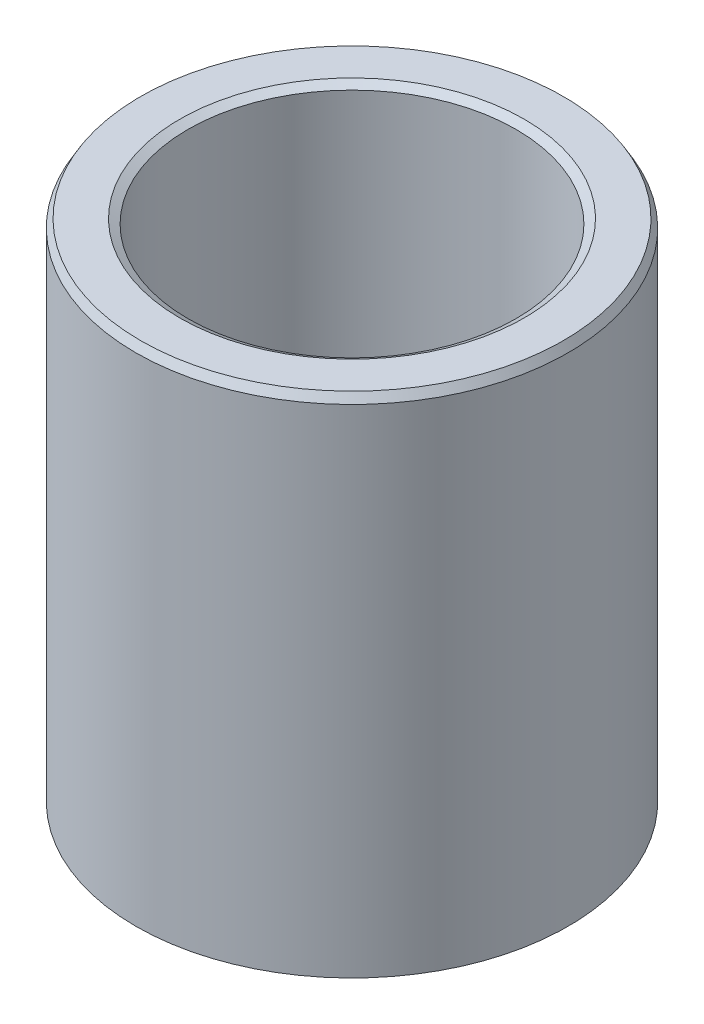
ISO-10303-21;
HEADER;
FILE_DESCRIPTION(('STEP AP214'),'2;1');
FILE_NAME('part.step','',(''),(''),'','','');
FILE_SCHEMA(('AUTOMOTIVE_DESIGN { 1 0 10303 214 1 1 1 1 }'));
ENDSEC;
DATA;
#1=APPLICATION_CONTEXT('core data for automotive mechanical design processes');
#2=APPLICATION_PROTOCOL_DEFINITION('international standard','automotive_design',2000,#1);
#3=PRODUCT_CONTEXT('',#1,'mechanical');
#4=PRODUCT('Part','Part','',(#3));
#5=PRODUCT_RELATED_PRODUCT_CATEGORY('part','',(#4));
#6=PRODUCT_DEFINITION_FORMATION('','',#4);
#7=PRODUCT_DEFINITION_CONTEXT('part definition',#1,'design');
#8=PRODUCT_DEFINITION('design','',#6,#7);
#9=PRODUCT_DEFINITION_SHAPE('','',#8);
#10=(LENGTH_UNIT() NAMED_UNIT(*) SI_UNIT(.MILLI.,.METRE.));
#11=(NAMED_UNIT(*) PLANE_ANGLE_UNIT() SI_UNIT($,.RADIAN.));
#12=(NAMED_UNIT(*) SI_UNIT($,.STERADIAN.) SOLID_ANGLE_UNIT());
#13=UNCERTAINTY_MEASURE_WITH_UNIT(LENGTH_MEASURE(1.E-05),#10,'distance_accuracy_value','');
#14=(GEOMETRIC_REPRESENTATION_CONTEXT(3) GLOBAL_UNCERTAINTY_ASSIGNED_CONTEXT((#13)) GLOBAL_UNIT_ASSIGNED_CONTEXT((#10,
#11,#12)) REPRESENTATION_CONTEXT('',''));
#15=CARTESIAN_POINT('',(0.,0.,0.));
#16=DIRECTION('',(0.,0.,1.));
#17=DIRECTION('',(1.,0.,0.));
#18=AXIS2_PLACEMENT_3D('',#15,#16,#17);
#19=CARTESIAN_POINT('',(0.,53.0455599645674,0.));
#20=DIRECTION('',(0.,-1.,0.));
#21=DIRECTION('',(0.,0.,-1.));
#22=AXIS2_PLACEMENT_3D('',#19,#20,#21);
#23=CYLINDRICAL_SURFACE('',#22,22.5);
#24=CARTESIAN_POINT('',(0.,0.492375439828226,0.));
#25=DIRECTION('',(0.,1.,0.));
#26=DIRECTION('',(0.,0.,1.));
#27=AXIS2_PLACEMENT_3D('',#24,#25,#26);
#28=CIRCLE('',#27,22.5);
#29=CARTESIAN_POINT('',(0.,0.492375439828226,22.5));
#30=VERTEX_POINT('',#29);
#31=EDGE_CURVE('E10',#30,#30,#28,.T.);
#32=ORIENTED_EDGE('',*,*,#31,.T.);
#33=EDGE_LOOP('',(#32));
#34=FACE_BOUND('',#33,.T.);
#35=CARTESIAN_POINT('',(0.,52.1927406863858,0.));
#36=DIRECTION('',(0.,1.,0.));
#37=DIRECTION('',(0.,0.,1.));
#38=AXIS2_PLACEMENT_3D('',#35,#36,#37);
#39=CIRCLE('',#38,22.5);
#40=CARTESIAN_POINT('',(0.,52.1927406863858,22.5));
#41=VERTEX_POINT('',#40);
#42=EDGE_CURVE('E50',#41,#41,#39,.F.);
#43=ORIENTED_EDGE('',*,*,#42,.T.);
#44=EDGE_LOOP('',(#43));
#45=FACE_BOUND('',#44,.T.);
#46=ADVANCED_FACE('F39',(#34,#45),#23,.T.);
#47=CARTESIAN_POINT('',(0.,53.0455599645674,0.));
#48=DIRECTION('',(0.,1.,0.));
#49=DIRECTION('',(0.,0.,1.));
#50=AXIS2_PLACEMENT_3D('',#47,#48,#49);
#51=PLANE('',#50);
#52=CARTESIAN_POINT('',(0.,53.0455599645674,0.));
#53=DIRECTION('',(0.,1.,0.));
#54=DIRECTION('',(0.,0.,1.));
#55=AXIS2_PLACEMENT_3D('',#52,#53,#54);
#56=CIRCLE('',#55,17.925211019149);
#57=CARTESIAN_POINT('',(0.,53.0455599645674,17.925211019149));
#58=VERTEX_POINT('',#57);
#59=EDGE_CURVE('E58',#58,#58,#56,.F.);
#60=ORIENTED_EDGE('',*,*,#59,.T.);
#61=EDGE_LOOP('',(#60));
#62=FACE_BOUND('',#61,.T.);
#63=CARTESIAN_POINT('',(0.,53.0455599645674,0.));
#64=DIRECTION('',(0.,1.,0.));
#65=DIRECTION('',(0.,0.,1.));
#66=AXIS2_PLACEMENT_3D('',#63,#64,#65);
#67=CIRCLE('',#66,22.0076245601718);
#68=CARTESIAN_POINT('',(0.,53.0455599645674,22.0076245601718));
#69=VERTEX_POINT('',#68);
#70=EDGE_CURVE('E61',#69,#69,#67,.T.);
#71=ORIENTED_EDGE('',*,*,#70,.T.);
#72=EDGE_LOOP('',(#71));
#73=FACE_BOUND('',#72,.T.);
#74=ADVANCED_FACE('F88',(#62,#73),#51,.T.);
#75=CARTESIAN_POINT('',(0.,0.,0.));
#76=DIRECTION('',(0.,1.,0.));
#77=DIRECTION('',(0.,0.,1.));
#78=AXIS2_PLACEMENT_3D('',#75,#76,#77);
#79=PLANE('',#78);
#80=CARTESIAN_POINT('',(0.,0.,0.));
#81=DIRECTION('',(0.,1.,0.));
#82=DIRECTION('',(0.,0.,1.));
#83=AXIS2_PLACEMENT_3D('',#80,#81,#82);
#84=CIRCLE('',#83,17.5647671807957);
#85=CARTESIAN_POINT('',(0.,0.,17.5647671807957));
#86=VERTEX_POINT('',#85);
#87=EDGE_CURVE('E51',#86,#86,#84,.T.);
#88=ORIENTED_EDGE('',*,*,#87,.T.);
#89=EDGE_LOOP('',(#88));
#90=FACE_BOUND('',#89,.T.);
#91=CARTESIAN_POINT('',(0.,0.,0.));
#92=DIRECTION('',(0.,1.,0.));
#93=DIRECTION('',(0.,0.,1.));
#94=AXIS2_PLACEMENT_3D('',#91,#92,#93);
#95=CIRCLE('',#94,21.6471807218184);
#96=CARTESIAN_POINT('',(0.,0.,21.6471807218184));
#97=VERTEX_POINT('',#96);
#98=EDGE_CURVE('E54',#97,#97,#95,.F.);
#99=ORIENTED_EDGE('',*,*,#98,.T.);
#100=EDGE_LOOP('',(#99));
#101=FACE_BOUND('',#100,.T.);
#102=ADVANCED_FACE('F83',(#90,#101),#79,.F.);
#103=CARTESIAN_POINT('',(0.,53.0455599645674,0.));
#104=DIRECTION('',(0.,-1.,0.));
#105=DIRECTION('',(0.,0.,-1.));
#106=AXIS2_PLACEMENT_3D('',#103,#104,#105);
#107=CYLINDRICAL_SURFACE('',#106,17.0723917409675);
#108=CARTESIAN_POINT('',(0.,52.5531845247391,0.));
#109=DIRECTION('',(0.,1.,0.));
#110=DIRECTION('',(0.,0.,1.));
#111=AXIS2_PLACEMENT_3D('',#108,#109,#110);
#112=CIRCLE('',#111,17.0723917409675);
#113=CARTESIAN_POINT('',(0.,52.5531845247391,17.0723917409675));
#114=VERTEX_POINT('',#113);
#115=EDGE_CURVE('E67',#114,#114,#112,.T.);
#116=ORIENTED_EDGE('',*,*,#115,.T.);
#117=EDGE_LOOP('',(#116));
#118=FACE_BOUND('',#117,.T.);
#119=CARTESIAN_POINT('',(0.,0.852819278181545,0.));
#120=DIRECTION('',(0.,1.,0.));
#121=DIRECTION('',(0.,0.,1.));
#122=AXIS2_PLACEMENT_3D('',#119,#120,#121);
#123=CIRCLE('',#122,17.0723917409675);
#124=CARTESIAN_POINT('',(0.,0.852819278181545,17.0723917409675));
#125=VERTEX_POINT('',#124);
#126=EDGE_CURVE('E69',#125,#125,#123,.F.);
#127=ORIENTED_EDGE('',*,*,#126,.T.);
#128=EDGE_LOOP('',(#127));
#129=FACE_BOUND('',#128,.T.);
#130=ADVANCED_FACE('F71',(#118,#129),#107,.F.);
#131=CARTESIAN_POINT('',(0.,52.5531845247391,0.));
#132=DIRECTION('',(0.,1.,0.));
#133=DIRECTION('',(0.,0.,1.));
#134=AXIS2_PLACEMENT_3D('',#131,#132,#133);
#135=CONICAL_SURFACE('',#134,17.0723917409675,1.0471975511966);
#136=ORIENTED_EDGE('',*,*,#59,.F.);
#137=EDGE_LOOP('',(#136));
#138=FACE_BOUND('',#137,.T.);
#139=ORIENTED_EDGE('',*,*,#115,.F.);
#140=EDGE_LOOP('',(#139));
#141=FACE_BOUND('',#140,.T.);
#142=ADVANCED_FACE('F77',(#138,#141),#135,.F.);
#143=CARTESIAN_POINT('',(0.,0.,0.));
#144=DIRECTION('',(0.,-1.,0.));
#145=DIRECTION('',(0.,0.,-1.));
#146=AXIS2_PLACEMENT_3D('',#143,#144,#145);
#147=CONICAL_SURFACE('',#146,17.5647671807957,0.523598775598294);
#148=ORIENTED_EDGE('',*,*,#126,.F.);
#149=EDGE_LOOP('',(#148));
#150=FACE_BOUND('',#149,.T.);
#151=ORIENTED_EDGE('',*,*,#87,.F.);
#152=EDGE_LOOP('',(#151));
#153=FACE_BOUND('',#152,.T.);
#154=ADVANCED_FACE('F73',(#150,#153),#147,.F.);
#155=CARTESIAN_POINT('',(0.,0.492375439828226,0.));
#156=DIRECTION('',(0.,1.,0.));
#157=DIRECTION('',(0.,0.,1.));
#158=AXIS2_PLACEMENT_3D('',#155,#156,#157);
#159=CONICAL_SURFACE('',#158,22.5,1.0471975511966);
#160=ORIENTED_EDGE('',*,*,#98,.F.);
#161=EDGE_LOOP('',(#160));
#162=FACE_BOUND('',#161,.T.);
#163=ORIENTED_EDGE('',*,*,#31,.F.);
#164=EDGE_LOOP('',(#163));
#165=FACE_BOUND('',#164,.T.);
#166=ADVANCED_FACE('F76',(#162,#165),#159,.T.);
#167=CARTESIAN_POINT('',(0.,53.0455599645674,0.));
#168=DIRECTION('',(0.,-1.,0.));
#169=DIRECTION('',(0.,0.,-1.));
#170=AXIS2_PLACEMENT_3D('',#167,#168,#169);
#171=CONICAL_SURFACE('',#170,22.0076245601718,0.523598775598288);
#172=ORIENTED_EDGE('',*,*,#42,.F.);
#173=EDGE_LOOP('',(#172));
#174=FACE_BOUND('',#173,.T.);
#175=ORIENTED_EDGE('',*,*,#70,.F.);
#176=EDGE_LOOP('',(#175));
#177=FACE_BOUND('',#176,.T.);
#178=ADVANCED_FACE('F45',(#174,#177),#171,.T.);
#179=CLOSED_SHELL('',(#46,#74,#102,#130,#142,#154,#166,#178));
#180=MANIFOLD_SOLID_BREP('B2',#179);
#181=ADVANCED_BREP_SHAPE_REPRESENTATION('',(#18,#180),#14);
#182=SHAPE_DEFINITION_REPRESENTATION(#9,#181);
ENDSEC;
END-ISO-10303-21;
